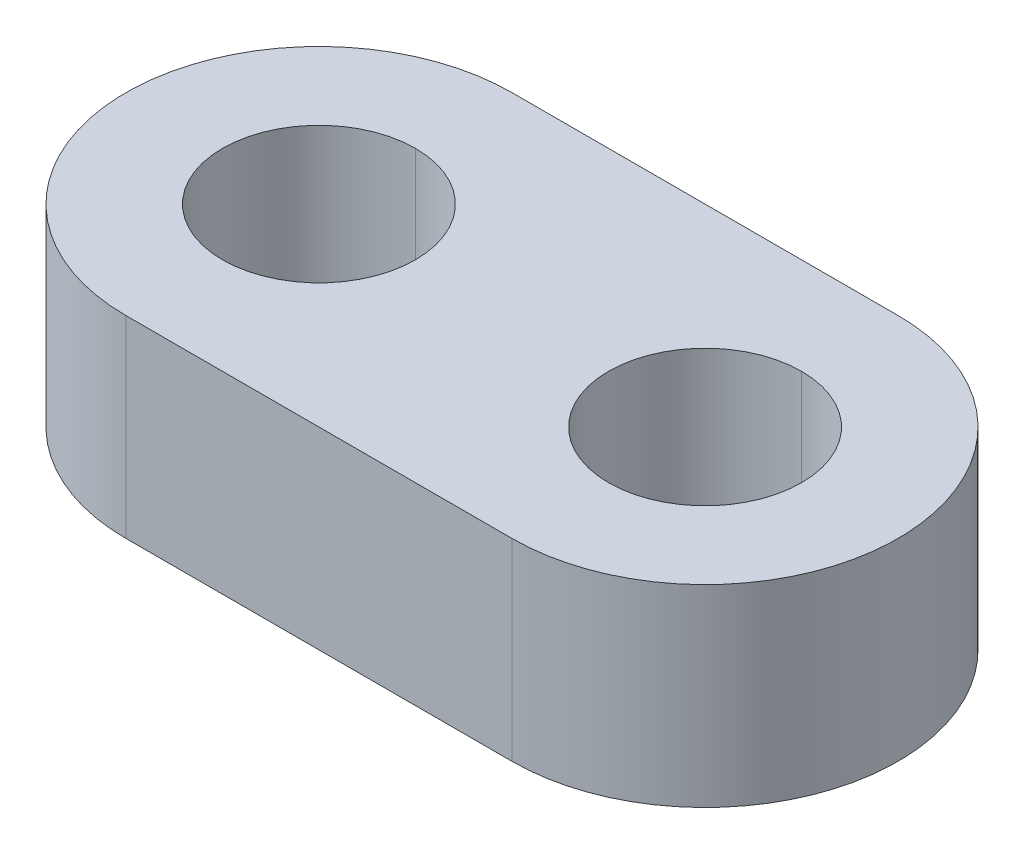
ISO-10303-21;
HEADER;
FILE_DESCRIPTION(('STEP AP214'),'2;1');
FILE_NAME('part.step','',(''),(''),'','','');
FILE_SCHEMA(('AUTOMOTIVE_DESIGN { 1 0 10303 214 1 1 1 1 }'));
ENDSEC;
DATA;
#1=APPLICATION_CONTEXT('core data for automotive mechanical design processes');
#2=APPLICATION_PROTOCOL_DEFINITION('international standard','automotive_design',2000,#1);
#3=PRODUCT_CONTEXT('',#1,'mechanical');
#4=PRODUCT('Part','Part','',(#3));
#5=PRODUCT_RELATED_PRODUCT_CATEGORY('part','',(#4));
#6=PRODUCT_DEFINITION_FORMATION('','',#4);
#7=PRODUCT_DEFINITION_CONTEXT('part definition',#1,'design');
#8=PRODUCT_DEFINITION('design','',#6,#7);
#9=PRODUCT_DEFINITION_SHAPE('','',#8);
#10=(LENGTH_UNIT() NAMED_UNIT(*) SI_UNIT(.MILLI.,.METRE.));
#11=(NAMED_UNIT(*) PLANE_ANGLE_UNIT() SI_UNIT($,.RADIAN.));
#12=(NAMED_UNIT(*) SI_UNIT($,.STERADIAN.) SOLID_ANGLE_UNIT());
#13=UNCERTAINTY_MEASURE_WITH_UNIT(LENGTH_MEASURE(1.E-05),#10,'distance_accuracy_value','');
#14=(GEOMETRIC_REPRESENTATION_CONTEXT(3) GLOBAL_UNCERTAINTY_ASSIGNED_CONTEXT((#13)) GLOBAL_UNIT_ASSIGNED_CONTEXT((#10,
#11,#12)) REPRESENTATION_CONTEXT('',''));
#15=CARTESIAN_POINT('',(0.,0.,0.));
#16=DIRECTION('',(0.,0.,1.));
#17=DIRECTION('',(1.,0.,0.));
#18=AXIS2_PLACEMENT_3D('',#15,#16,#17);
#19=CARTESIAN_POINT('',(4.,4.,0.));
#20=DIRECTION('',(0.,1.,0.));
#21=DIRECTION('',(0.,0.,1.));
#22=AXIS2_PLACEMENT_3D('',#19,#20,#21);
#23=CYLINDRICAL_SURFACE('',#22,2.);
#24=DIRECTION('',(0.,1.,0.));
#25=VECTOR('',#24,1.);
#26=CARTESIAN_POINT('',(4.,4.,-2.));
#27=LINE('',#26,#25);
#28=CARTESIAN_POINT('',(4.,0.,-2.));
#29=VERTEX_POINT('',#28);
#30=CARTESIAN_POINT('',(4.,4.,-2.));
#31=VERTEX_POINT('',#30);
#32=EDGE_CURVE('E171',#29,#31,#27,.T.);
#33=ORIENTED_EDGE('',*,*,#32,.F.);
#34=CARTESIAN_POINT('',(4.,0.,0.));
#35=DIRECTION('',(0.,1.,0.));
#36=DIRECTION('',(0.,0.,1.));
#37=AXIS2_PLACEMENT_3D('',#34,#35,#36);
#38=CIRCLE('',#37,2.);
#39=CARTESIAN_POINT('',(4.,0.,2.));
#40=VERTEX_POINT('',#39);
#41=EDGE_CURVE('E24',#40,#29,#38,.T.);
#42=ORIENTED_EDGE('',*,*,#41,.F.);
#43=DIRECTION('',(0.,1.,0.));
#44=VECTOR('',#43,1.);
#45=CARTESIAN_POINT('',(4.,4.,2.));
#46=LINE('',#45,#44);
#47=CARTESIAN_POINT('',(4.,4.,2.));
#48=VERTEX_POINT('',#47);
#49=EDGE_CURVE('E179',#40,#48,#46,.T.);
#50=ORIENTED_EDGE('',*,*,#49,.T.);
#51=CARTESIAN_POINT('',(4.,4.,0.));
#52=DIRECTION('',(0.,1.,0.));
#53=DIRECTION('',(0.,0.,1.));
#54=AXIS2_PLACEMENT_3D('',#51,#52,#53);
#55=CIRCLE('',#54,2.);
#56=EDGE_CURVE('E156',#48,#31,#55,.T.);
#57=ORIENTED_EDGE('',*,*,#56,.T.);
#58=EDGE_LOOP('',(#33,#42,#50,#57));
#59=FACE_BOUND('',#58,.T.);
#60=ADVANCED_FACE('F16',(#59),#23,.F.);
#61=CARTESIAN_POINT('',(-4.,4.,0.));
#62=DIRECTION('',(0.,1.,0.));
#63=DIRECTION('',(0.,0.,1.));
#64=AXIS2_PLACEMENT_3D('',#61,#62,#63);
#65=CYLINDRICAL_SURFACE('',#64,2.);
#66=DIRECTION('',(0.,1.,0.));
#67=VECTOR('',#66,1.);
#68=CARTESIAN_POINT('',(-4.,4.,-2.));
#69=LINE('',#68,#67);
#70=CARTESIAN_POINT('',(-4.,0.,-2.));
#71=VERTEX_POINT('',#70);
#72=CARTESIAN_POINT('',(-4.,4.,-2.));
#73=VERTEX_POINT('',#72);
#74=EDGE_CURVE('E195',#71,#73,#69,.T.);
#75=ORIENTED_EDGE('',*,*,#74,.F.);
#76=CARTESIAN_POINT('',(-4.,0.,0.));
#77=DIRECTION('',(0.,1.,0.));
#78=DIRECTION('',(0.,0.,1.));
#79=AXIS2_PLACEMENT_3D('',#76,#77,#78);
#80=CIRCLE('',#79,2.);
#81=CARTESIAN_POINT('',(-4.,0.,2.));
#82=VERTEX_POINT('',#81);
#83=EDGE_CURVE('E10',#82,#71,#80,.T.);
#84=ORIENTED_EDGE('',*,*,#83,.F.);
#85=DIRECTION('',(0.,1.,0.));
#86=VECTOR('',#85,1.);
#87=CARTESIAN_POINT('',(-4.,4.,2.));
#88=LINE('',#87,#86);
#89=CARTESIAN_POINT('',(-4.,4.,2.));
#90=VERTEX_POINT('',#89);
#91=EDGE_CURVE('E127',#82,#90,#88,.T.);
#92=ORIENTED_EDGE('',*,*,#91,.T.);
#93=CARTESIAN_POINT('',(-4.,4.,0.));
#94=DIRECTION('',(0.,1.,0.));
#95=DIRECTION('',(0.,0.,1.));
#96=AXIS2_PLACEMENT_3D('',#93,#94,#95);
#97=CIRCLE('',#96,2.);
#98=EDGE_CURVE('E157',#90,#73,#97,.T.);
#99=ORIENTED_EDGE('',*,*,#98,.T.);
#100=EDGE_LOOP('',(#75,#84,#92,#99));
#101=FACE_BOUND('',#100,.T.);
#102=ADVANCED_FACE('F222',(#101),#65,.F.);
#103=CARTESIAN_POINT('',(-4.,0.,0.));
#104=DIRECTION('',(0.,1.,0.));
#105=DIRECTION('',(1.,0.,0.));
#106=AXIS2_PLACEMENT_3D('',#103,#104,#105);
#107=PLANE('',#106);
#108=ORIENTED_EDGE('',*,*,#83,.T.);
#109=CARTESIAN_POINT('',(-4.,0.,0.));
#110=DIRECTION('',(0.,1.,0.));
#111=DIRECTION('',(0.,0.,1.));
#112=AXIS2_PLACEMENT_3D('',#109,#110,#111);
#113=CIRCLE('',#112,2.);
#114=EDGE_CURVE('E191',#71,#82,#113,.T.);
#115=ORIENTED_EDGE('',*,*,#114,.T.);
#116=EDGE_LOOP('',(#108,#115));
#117=FACE_BOUND('',#116,.T.);
#118=ORIENTED_EDGE('',*,*,#41,.T.);
#119=CARTESIAN_POINT('',(4.,0.,0.));
#120=DIRECTION('',(0.,1.,0.));
#121=DIRECTION('',(0.,0.,1.));
#122=AXIS2_PLACEMENT_3D('',#119,#120,#121);
#123=CIRCLE('',#122,2.);
#124=EDGE_CURVE('E166',#29,#40,#123,.T.);
#125=ORIENTED_EDGE('',*,*,#124,.T.);
#126=EDGE_LOOP('',(#118,#125));
#127=FACE_BOUND('',#126,.T.);
#128=CARTESIAN_POINT('',(-4.,0.,0.));
#129=DIRECTION('',(0.,1.,0.));
#130=DIRECTION('',(0.,0.,1.));
#131=AXIS2_PLACEMENT_3D('',#128,#129,#130);
#132=CIRCLE('',#131,4.);
#133=CARTESIAN_POINT('',(-4.,0.,-4.));
#134=VERTEX_POINT('',#133);
#135=CARTESIAN_POINT('',(-4.,0.,4.));
#136=VERTEX_POINT('',#135);
#137=EDGE_CURVE('E116',#134,#136,#132,.T.);
#138=ORIENTED_EDGE('',*,*,#137,.F.);
#139=DIRECTION('',(-1.,0.,0.));
#140=VECTOR('',#139,1.);
#141=CARTESIAN_POINT('',(-4.,0.,-4.));
#142=LINE('',#141,#140);
#143=CARTESIAN_POINT('',(4.,0.,-4.));
#144=VERTEX_POINT('',#143);
#145=EDGE_CURVE('E48',#144,#134,#142,.T.);
#146=ORIENTED_EDGE('',*,*,#145,.F.);
#147=CARTESIAN_POINT('',(4.,0.,0.));
#148=DIRECTION('',(0.,1.,0.));
#149=DIRECTION('',(0.,0.,1.));
#150=AXIS2_PLACEMENT_3D('',#147,#148,#149);
#151=CIRCLE('',#150,4.);
#152=CARTESIAN_POINT('',(4.,0.,4.));
#153=VERTEX_POINT('',#152);
#154=EDGE_CURVE('E139',#153,#144,#151,.T.);
#155=ORIENTED_EDGE('',*,*,#154,.F.);
#156=DIRECTION('',(1.,0.,0.));
#157=VECTOR('',#156,1.);
#158=CARTESIAN_POINT('',(-4.,0.,4.));
#159=LINE('',#158,#157);
#160=EDGE_CURVE('E120',#136,#153,#159,.T.);
#161=ORIENTED_EDGE('',*,*,#160,.F.);
#162=EDGE_LOOP('',(#138,#146,#155,#161));
#163=FACE_BOUND('',#162,.T.);
#164=ADVANCED_FACE('F122',(#117,#127,#163),#107,.F.);
#165=CARTESIAN_POINT('',(-4.,4.,0.));
#166=DIRECTION('',(0.,1.,0.));
#167=DIRECTION('',(1.,0.,0.));
#168=AXIS2_PLACEMENT_3D('',#165,#166,#167);
#169=PLANE('',#168);
#170=ORIENTED_EDGE('',*,*,#98,.F.);
#171=CARTESIAN_POINT('',(-4.,4.,0.));
#172=DIRECTION('',(0.,1.,0.));
#173=DIRECTION('',(0.,0.,1.));
#174=AXIS2_PLACEMENT_3D('',#171,#172,#173);
#175=CIRCLE('',#174,2.);
#176=EDGE_CURVE('E136',#73,#90,#175,.T.);
#177=ORIENTED_EDGE('',*,*,#176,.F.);
#178=EDGE_LOOP('',(#170,#177));
#179=FACE_BOUND('',#178,.T.);
#180=ORIENTED_EDGE('',*,*,#56,.F.);
#181=CARTESIAN_POINT('',(4.,4.,0.));
#182=DIRECTION('',(0.,1.,0.));
#183=DIRECTION('',(0.,0.,1.));
#184=AXIS2_PLACEMENT_3D('',#181,#182,#183);
#185=CIRCLE('',#184,2.);
#186=EDGE_CURVE('E176',#31,#48,#185,.T.);
#187=ORIENTED_EDGE('',*,*,#186,.F.);
#188=EDGE_LOOP('',(#180,#187));
#189=FACE_BOUND('',#188,.T.);
#190=CARTESIAN_POINT('',(-4.,4.,0.));
#191=DIRECTION('',(0.,1.,0.));
#192=DIRECTION('',(0.,0.,1.));
#193=AXIS2_PLACEMENT_3D('',#190,#191,#192);
#194=CIRCLE('',#193,4.);
#195=CARTESIAN_POINT('',(-4.,4.,-4.));
#196=VERTEX_POINT('',#195);
#197=CARTESIAN_POINT('',(-4.,4.,4.));
#198=VERTEX_POINT('',#197);
#199=EDGE_CURVE('E118',#196,#198,#194,.T.);
#200=ORIENTED_EDGE('',*,*,#199,.T.);
#201=DIRECTION('',(1.,0.,0.));
#202=VECTOR('',#201,1.);
#203=CARTESIAN_POINT('',(-4.,4.,4.));
#204=LINE('',#203,#202);
#205=CARTESIAN_POINT('',(4.,4.,4.));
#206=VERTEX_POINT('',#205);
#207=EDGE_CURVE('E141',#198,#206,#204,.T.);
#208=ORIENTED_EDGE('',*,*,#207,.T.);
#209=CARTESIAN_POINT('',(4.,4.,0.));
#210=DIRECTION('',(0.,1.,0.));
#211=DIRECTION('',(0.,0.,1.));
#212=AXIS2_PLACEMENT_3D('',#209,#210,#211);
#213=CIRCLE('',#212,4.);
#214=CARTESIAN_POINT('',(4.,4.,-4.));
#215=VERTEX_POINT('',#214);
#216=EDGE_CURVE('E110',#206,#215,#213,.T.);
#217=ORIENTED_EDGE('',*,*,#216,.T.);
#218=DIRECTION('',(-1.,0.,0.));
#219=VECTOR('',#218,1.);
#220=CARTESIAN_POINT('',(-4.,4.,-4.));
#221=LINE('',#220,#219);
#222=EDGE_CURVE('E37',#215,#196,#221,.T.);
#223=ORIENTED_EDGE('',*,*,#222,.T.);
#224=EDGE_LOOP('',(#200,#208,#217,#223));
#225=FACE_BOUND('',#224,.T.);
#226=ADVANCED_FACE('F212',(#179,#189,#225),#169,.T.);
#227=CARTESIAN_POINT('',(-4.,4.,-4.));
#228=DIRECTION('',(0.,0.,1.));
#229=DIRECTION('',(1.,0.,0.));
#230=AXIS2_PLACEMENT_3D('',#227,#228,#229);
#231=PLANE('',#230);
#232=ORIENTED_EDGE('',*,*,#145,.T.);
#233=DIRECTION('',(0.,-1.,0.));
#234=VECTOR('',#233,1.);
#235=CARTESIAN_POINT('',(-4.,4.,-4.));
#236=LINE('',#235,#234);
#237=EDGE_CURVE('E104',#196,#134,#236,.T.);
#238=ORIENTED_EDGE('',*,*,#237,.F.);
#239=ORIENTED_EDGE('',*,*,#222,.F.);
#240=DIRECTION('',(0.,-1.,0.));
#241=VECTOR('',#240,1.);
#242=CARTESIAN_POINT('',(4.,4.,-4.));
#243=LINE('',#242,#241);
#244=EDGE_CURVE('E107',#215,#144,#243,.T.);
#245=ORIENTED_EDGE('',*,*,#244,.T.);
#246=EDGE_LOOP('',(#232,#238,#239,#245));
#247=FACE_BOUND('',#246,.T.);
#248=ADVANCED_FACE('F103',(#247),#231,.F.);
#249=CARTESIAN_POINT('',(4.,4.,0.));
#250=DIRECTION('',(0.,-1.,0.));
#251=DIRECTION('',(0.,0.,-1.));
#252=AXIS2_PLACEMENT_3D('',#249,#250,#251);
#253=CYLINDRICAL_SURFACE('',#252,4.);
#254=ORIENTED_EDGE('',*,*,#154,.T.);
#255=ORIENTED_EDGE('',*,*,#244,.F.);
#256=ORIENTED_EDGE('',*,*,#216,.F.);
#257=DIRECTION('',(0.,-1.,0.));
#258=VECTOR('',#257,1.);
#259=CARTESIAN_POINT('',(4.,4.,4.));
#260=LINE('',#259,#258);
#261=EDGE_CURVE('E145',#206,#153,#260,.T.);
#262=ORIENTED_EDGE('',*,*,#261,.T.);
#263=EDGE_LOOP('',(#254,#255,#256,#262));
#264=FACE_BOUND('',#263,.T.);
#265=ADVANCED_FACE('F208',(#264),#253,.T.);
#266=CARTESIAN_POINT('',(-4.,4.,4.));
#267=DIRECTION('',(0.,0.,-1.));
#268=DIRECTION('',(0.,-1.,0.));
#269=AXIS2_PLACEMENT_3D('',#266,#267,#268);
#270=PLANE('',#269);
#271=ORIENTED_EDGE('',*,*,#160,.T.);
#272=ORIENTED_EDGE('',*,*,#261,.F.);
#273=ORIENTED_EDGE('',*,*,#207,.F.);
#274=DIRECTION('',(0.,-1.,0.));
#275=VECTOR('',#274,1.);
#276=CARTESIAN_POINT('',(-4.,4.,4.));
#277=LINE('',#276,#275);
#278=EDGE_CURVE('E126',#198,#136,#277,.T.);
#279=ORIENTED_EDGE('',*,*,#278,.T.);
#280=EDGE_LOOP('',(#271,#272,#273,#279));
#281=FACE_BOUND('',#280,.T.);
#282=ADVANCED_FACE('F210',(#281),#270,.F.);
#283=CARTESIAN_POINT('',(-4.,4.,0.));
#284=DIRECTION('',(0.,-1.,0.));
#285=DIRECTION('',(0.,0.,-1.));
#286=AXIS2_PLACEMENT_3D('',#283,#284,#285);
#287=CYLINDRICAL_SURFACE('',#286,4.);
#288=ORIENTED_EDGE('',*,*,#137,.T.);
#289=ORIENTED_EDGE('',*,*,#278,.F.);
#290=ORIENTED_EDGE('',*,*,#199,.F.);
#291=ORIENTED_EDGE('',*,*,#237,.T.);
#292=EDGE_LOOP('',(#288,#289,#290,#291));
#293=FACE_BOUND('',#292,.T.);
#294=ADVANCED_FACE('F114',(#293),#287,.T.);
#295=CARTESIAN_POINT('',(-4.,4.,0.));
#296=DIRECTION('',(0.,1.,0.));
#297=DIRECTION('',(0.,0.,1.));
#298=AXIS2_PLACEMENT_3D('',#295,#296,#297);
#299=CYLINDRICAL_SURFACE('',#298,2.);
#300=ORIENTED_EDGE('',*,*,#114,.F.);
#301=ORIENTED_EDGE('',*,*,#74,.T.);
#302=ORIENTED_EDGE('',*,*,#176,.T.);
#303=ORIENTED_EDGE('',*,*,#91,.F.);
#304=EDGE_LOOP('',(#300,#301,#302,#303));
#305=FACE_BOUND('',#304,.T.);
#306=ADVANCED_FACE('F242',(#305),#299,.F.);
#307=CARTESIAN_POINT('',(4.,4.,0.));
#308=DIRECTION('',(0.,1.,0.));
#309=DIRECTION('',(0.,0.,1.));
#310=AXIS2_PLACEMENT_3D('',#307,#308,#309);
#311=CYLINDRICAL_SURFACE('',#310,2.);
#312=ORIENTED_EDGE('',*,*,#124,.F.);
#313=ORIENTED_EDGE('',*,*,#32,.T.);
#314=ORIENTED_EDGE('',*,*,#186,.T.);
#315=ORIENTED_EDGE('',*,*,#49,.F.);
#316=EDGE_LOOP('',(#312,#313,#314,#315));
#317=FACE_BOUND('',#316,.T.);
#318=ADVANCED_FACE('F178',(#317),#311,.F.);
#319=CLOSED_SHELL('',(#60,#102,#164,#226,#248,#265,#282,#294,#306,#318));
#320=MANIFOLD_SOLID_BREP('B1',#319);
#321=ADVANCED_BREP_SHAPE_REPRESENTATION('',(#18,#320),#14);
#322=SHAPE_DEFINITION_REPRESENTATION(#9,#321);
ENDSEC;
END-ISO-10303-21;
